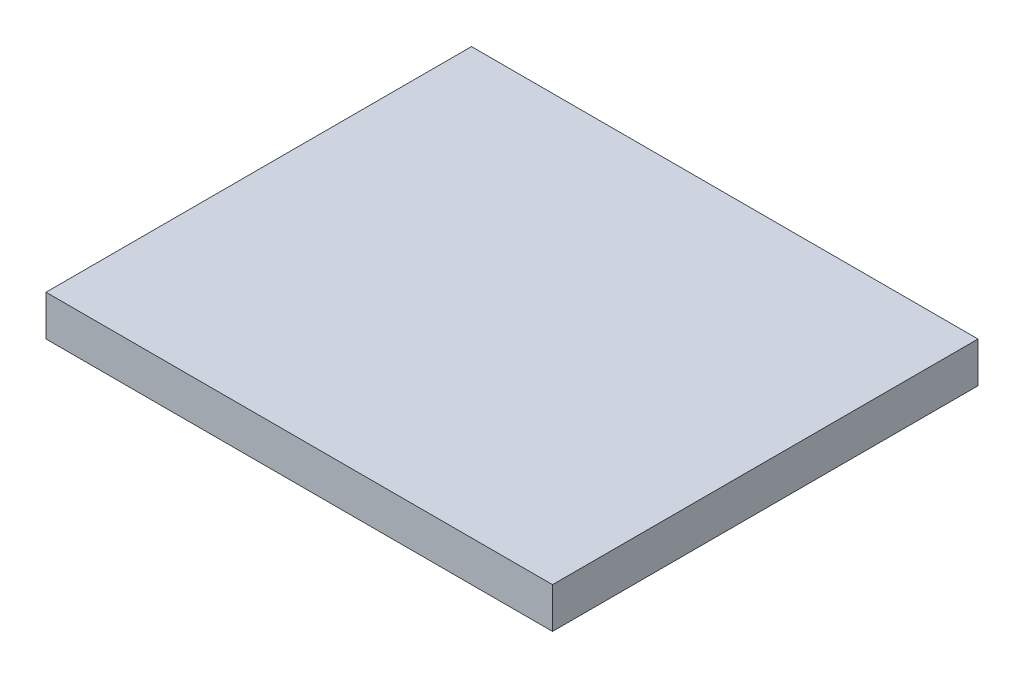
ISO-10303-21;
HEADER;
FILE_DESCRIPTION(('STEP AP214'),'2;1');
FILE_NAME('part.step','',(''),(''),'','','');
FILE_SCHEMA(('AUTOMOTIVE_DESIGN { 1 0 10303 214 1 1 1 1 }'));
ENDSEC;
DATA;
#1=APPLICATION_CONTEXT('core data for automotive mechanical design processes');
#2=APPLICATION_PROTOCOL_DEFINITION('international standard','automotive_design',2000,#1);
#3=PRODUCT_CONTEXT('',#1,'mechanical');
#4=PRODUCT('Part','Part','',(#3));
#5=PRODUCT_RELATED_PRODUCT_CATEGORY('part','',(#4));
#6=PRODUCT_DEFINITION_FORMATION('','',#4);
#7=PRODUCT_DEFINITION_CONTEXT('part definition',#1,'design');
#8=PRODUCT_DEFINITION('design','',#6,#7);
#9=PRODUCT_DEFINITION_SHAPE('','',#8);
#10=(LENGTH_UNIT() NAMED_UNIT(*) SI_UNIT(.MILLI.,.METRE.));
#11=(NAMED_UNIT(*) PLANE_ANGLE_UNIT() SI_UNIT($,.RADIAN.));
#12=(NAMED_UNIT(*) SI_UNIT($,.STERADIAN.) SOLID_ANGLE_UNIT());
#13=UNCERTAINTY_MEASURE_WITH_UNIT(LENGTH_MEASURE(1.E-05),#10,'distance_accuracy_value','');
#14=(GEOMETRIC_REPRESENTATION_CONTEXT(3) GLOBAL_UNCERTAINTY_ASSIGNED_CONTEXT((#13)) GLOBAL_UNIT_ASSIGNED_CONTEXT((#10,
#11,#12)) REPRESENTATION_CONTEXT('',''));
#15=CARTESIAN_POINT('',(0.,0.,0.));
#16=DIRECTION('',(0.,0.,1.));
#17=DIRECTION('',(1.,0.,0.));
#18=AXIS2_PLACEMENT_3D('',#15,#16,#17);
#19=CARTESIAN_POINT('',(450.,50.8,183.4));
#20=DIRECTION('',(0.,0.,-1.));
#21=DIRECTION('',(-1.,0.,0.));
#22=AXIS2_PLACEMENT_3D('',#19,#20,#21);
#23=PLANE('',#22);
#24=DIRECTION('',(1.,0.,0.));
#25=VECTOR('',#24,1.);
#26=CARTESIAN_POINT('',(450.,0.,183.4));
#27=LINE('',#26,#25);
#28=CARTESIAN_POINT('',(-185.,0.,183.4));
#29=VERTEX_POINT('',#28);
#30=CARTESIAN_POINT('',(450.,0.,183.4));
#31=VERTEX_POINT('',#30);
#32=EDGE_CURVE('E107',#29,#31,#27,.T.);
#33=ORIENTED_EDGE('',*,*,#32,.T.);
#34=DIRECTION('',(0.,-1.,0.));
#35=VECTOR('',#34,1.);
#36=CARTESIAN_POINT('',(450.,50.8,183.4));
#37=LINE('',#36,#35);
#38=CARTESIAN_POINT('',(450.,50.8,183.4));
#39=VERTEX_POINT('',#38);
#40=EDGE_CURVE('E11',#39,#31,#37,.T.);
#41=ORIENTED_EDGE('',*,*,#40,.F.);
#42=DIRECTION('',(1.,0.,0.));
#43=VECTOR('',#42,1.);
#44=CARTESIAN_POINT('',(450.,50.8,183.4));
#45=LINE('',#44,#43);
#46=CARTESIAN_POINT('',(-185.,50.8,183.4));
#47=VERTEX_POINT('',#46);
#48=EDGE_CURVE('E91',#47,#39,#45,.T.);
#49=ORIENTED_EDGE('',*,*,#48,.F.);
#50=DIRECTION('',(0.,-1.,0.));
#51=VECTOR('',#50,1.);
#52=CARTESIAN_POINT('',(-185.,50.8,183.4));
#53=LINE('',#52,#51);
#54=EDGE_CURVE('E103',#47,#29,#53,.T.);
#55=ORIENTED_EDGE('',*,*,#54,.T.);
#56=EDGE_LOOP('',(#33,#41,#49,#55));
#57=FACE_BOUND('',#56,.T.);
#58=ADVANCED_FACE('F39',(#57),#23,.F.);
#59=CARTESIAN_POINT('',(450.,50.8,-350.));
#60=DIRECTION('',(-1.,0.,0.));
#61=DIRECTION('',(0.,0.,1.));
#62=AXIS2_PLACEMENT_3D('',#59,#60,#61);
#63=PLANE('',#62);
#64=DIRECTION('',(0.,0.,-1.));
#65=VECTOR('',#64,1.);
#66=CARTESIAN_POINT('',(450.,0.,-350.));
#67=LINE('',#66,#65);
#68=CARTESIAN_POINT('',(450.,0.,-350.));
#69=VERTEX_POINT('',#68);
#70=EDGE_CURVE('E96',#31,#69,#67,.T.);
#71=ORIENTED_EDGE('',*,*,#70,.T.);
#72=DIRECTION('',(0.,-1.,0.));
#73=VECTOR('',#72,1.);
#74=CARTESIAN_POINT('',(450.,50.8,-350.));
#75=LINE('',#74,#73);
#76=CARTESIAN_POINT('',(450.,50.8,-350.));
#77=VERTEX_POINT('',#76);
#78=EDGE_CURVE('E48',#77,#69,#75,.T.);
#79=ORIENTED_EDGE('',*,*,#78,.F.);
#80=DIRECTION('',(0.,0.,-1.));
#81=VECTOR('',#80,1.);
#82=CARTESIAN_POINT('',(450.,50.8,-350.));
#83=LINE('',#82,#81);
#84=EDGE_CURVE('E86',#39,#77,#83,.T.);
#85=ORIENTED_EDGE('',*,*,#84,.F.);
#86=ORIENTED_EDGE('',*,*,#40,.T.);
#87=EDGE_LOOP('',(#71,#79,#85,#86));
#88=FACE_BOUND('',#87,.T.);
#89=ADVANCED_FACE('F95',(#88),#63,.F.);
#90=CARTESIAN_POINT('',(450.,50.8,-350.));
#91=DIRECTION('',(0.,0.,1.));
#92=DIRECTION('',(1.,0.,0.));
#93=AXIS2_PLACEMENT_3D('',#90,#91,#92);
#94=PLANE('',#93);
#95=DIRECTION('',(-1.,0.,0.));
#96=VECTOR('',#95,1.);
#97=CARTESIAN_POINT('',(450.,0.,-350.));
#98=LINE('',#97,#96);
#99=CARTESIAN_POINT('',(-185.,0.,-350.));
#100=VERTEX_POINT('',#99);
#101=EDGE_CURVE('E73',#69,#100,#98,.T.);
#102=ORIENTED_EDGE('',*,*,#101,.T.);
#103=DIRECTION('',(0.,-1.,0.));
#104=VECTOR('',#103,1.);
#105=CARTESIAN_POINT('',(-185.,50.8,-350.));
#106=LINE('',#105,#104);
#107=CARTESIAN_POINT('',(-185.,50.8,-350.));
#108=VERTEX_POINT('',#107);
#109=EDGE_CURVE('E98',#108,#100,#106,.T.);
#110=ORIENTED_EDGE('',*,*,#109,.F.);
#111=DIRECTION('',(-1.,0.,0.));
#112=VECTOR('',#111,1.);
#113=CARTESIAN_POINT('',(450.,50.8,-350.));
#114=LINE('',#113,#112);
#115=EDGE_CURVE('E89',#77,#108,#114,.T.);
#116=ORIENTED_EDGE('',*,*,#115,.F.);
#117=ORIENTED_EDGE('',*,*,#78,.T.);
#118=EDGE_LOOP('',(#102,#110,#116,#117));
#119=FACE_BOUND('',#118,.T.);
#120=ADVANCED_FACE('F99',(#119),#94,.F.);
#121=CARTESIAN_POINT('',(-185.,50.8,-350.));
#122=DIRECTION('',(1.,0.,0.));
#123=DIRECTION('',(0.,0.,-1.));
#124=AXIS2_PLACEMENT_3D('',#121,#122,#123);
#125=PLANE('',#124);
#126=DIRECTION('',(0.,0.,1.));
#127=VECTOR('',#126,1.);
#128=CARTESIAN_POINT('',(-185.,0.,-350.));
#129=LINE('',#128,#127);
#130=EDGE_CURVE('E79',#100,#29,#129,.T.);
#131=ORIENTED_EDGE('',*,*,#130,.T.);
#132=ORIENTED_EDGE('',*,*,#54,.F.);
#133=DIRECTION('',(0.,0.,1.));
#134=VECTOR('',#133,1.);
#135=CARTESIAN_POINT('',(-185.,50.8,-350.));
#136=LINE('',#135,#134);
#137=EDGE_CURVE('E56',#108,#47,#136,.T.);
#138=ORIENTED_EDGE('',*,*,#137,.F.);
#139=ORIENTED_EDGE('',*,*,#109,.T.);
#140=EDGE_LOOP('',(#131,#132,#138,#139));
#141=FACE_BOUND('',#140,.T.);
#142=ADVANCED_FACE('F120',(#141),#125,.F.);
#143=CARTESIAN_POINT('',(0.,50.8,0.));
#144=DIRECTION('',(0.,1.,0.));
#145=DIRECTION('',(0.,0.,1.));
#146=AXIS2_PLACEMENT_3D('',#143,#144,#145);
#147=PLANE('',#146);
#148=ORIENTED_EDGE('',*,*,#48,.T.);
#149=ORIENTED_EDGE('',*,*,#84,.T.);
#150=ORIENTED_EDGE('',*,*,#115,.T.);
#151=ORIENTED_EDGE('',*,*,#137,.T.);
#152=EDGE_LOOP('',(#148,#149,#150,#151));
#153=FACE_BOUND('',#152,.T.);
#154=ADVANCED_FACE('F87',(#153),#147,.T.);
#155=CARTESIAN_POINT('',(0.,0.,0.));
#156=DIRECTION('',(0.,1.,0.));
#157=DIRECTION('',(0.,0.,1.));
#158=AXIS2_PLACEMENT_3D('',#155,#156,#157);
#159=PLANE('',#158);
#160=ORIENTED_EDGE('',*,*,#32,.F.);
#161=ORIENTED_EDGE('',*,*,#130,.F.);
#162=ORIENTED_EDGE('',*,*,#101,.F.);
#163=ORIENTED_EDGE('',*,*,#70,.F.);
#164=EDGE_LOOP('',(#160,#161,#162,#163));
#165=FACE_BOUND('',#164,.T.);
#166=ADVANCED_FACE('F123',(#165),#159,.F.);
#167=CLOSED_SHELL('',(#58,#89,#120,#142,#154,#166));
#168=MANIFOLD_SOLID_BREP('B2',#167);
#169=ADVANCED_BREP_SHAPE_REPRESENTATION('',(#18,#168),#14);
#170=SHAPE_DEFINITION_REPRESENTATION(#9,#169);
ENDSEC;
END-ISO-10303-21;
